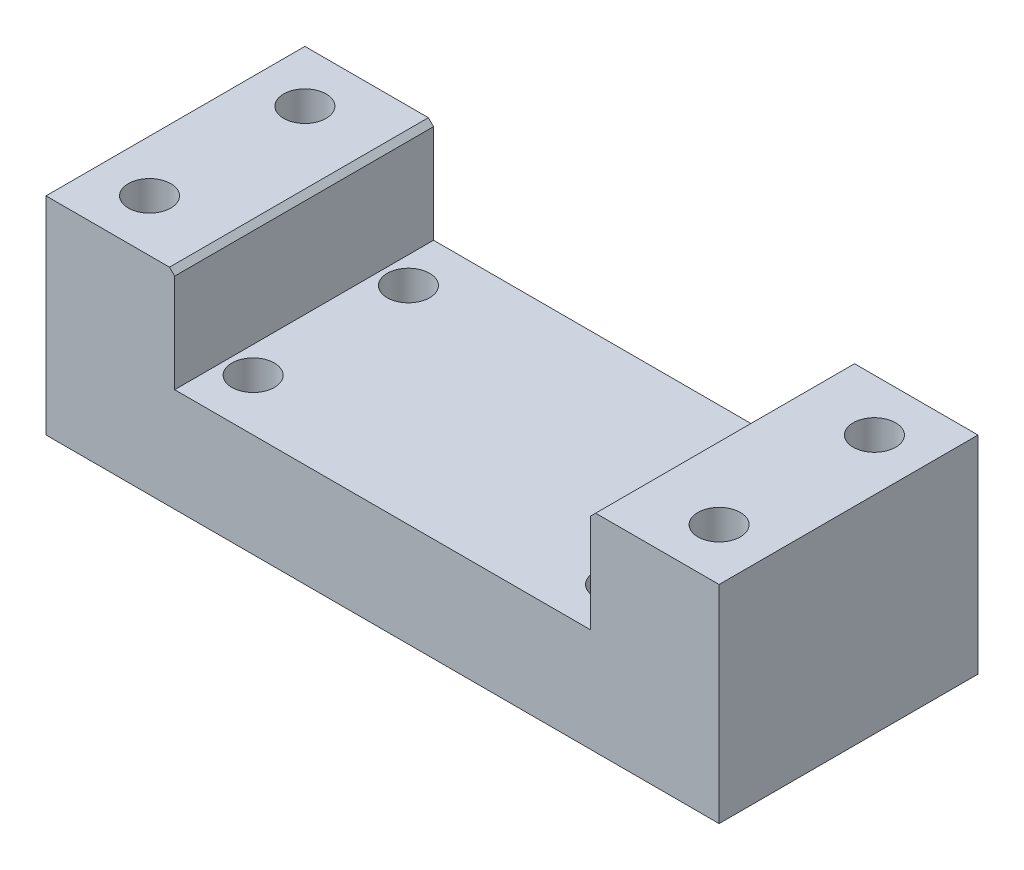
ISO-10303-21;
HEADER;
FILE_DESCRIPTION(('STEP AP214'),'2;1');
FILE_NAME('part.step','',(''),(''),'','','');
FILE_SCHEMA(('AUTOMOTIVE_DESIGN { 1 0 10303 214 1 1 1 1 }'));
ENDSEC;
DATA;
#1=APPLICATION_CONTEXT('core data for automotive mechanical design processes');
#2=APPLICATION_PROTOCOL_DEFINITION('international standard','automotive_design',2000,#1);
#3=PRODUCT_CONTEXT('',#1,'mechanical');
#4=PRODUCT('Part','Part','',(#3));
#5=PRODUCT_RELATED_PRODUCT_CATEGORY('part','',(#4));
#6=PRODUCT_DEFINITION_FORMATION('','',#4);
#7=PRODUCT_DEFINITION_CONTEXT('part definition',#1,'design');
#8=PRODUCT_DEFINITION('design','',#6,#7);
#9=PRODUCT_DEFINITION_SHAPE('','',#8);
#10=(LENGTH_UNIT() NAMED_UNIT(*) SI_UNIT(.MILLI.,.METRE.));
#11=(NAMED_UNIT(*) PLANE_ANGLE_UNIT() SI_UNIT($,.RADIAN.));
#12=(NAMED_UNIT(*) SI_UNIT($,.STERADIAN.) SOLID_ANGLE_UNIT());
#13=UNCERTAINTY_MEASURE_WITH_UNIT(LENGTH_MEASURE(1.E-05),#10,'distance_accuracy_value','');
#14=(GEOMETRIC_REPRESENTATION_CONTEXT(3) GLOBAL_UNCERTAINTY_ASSIGNED_CONTEXT((#13)) GLOBAL_UNIT_ASSIGNED_CONTEXT((#10,
#11,#12)) REPRESENTATION_CONTEXT('',''));
#15=CARTESIAN_POINT('',(0.,0.,0.));
#16=DIRECTION('',(0.,0.,1.));
#17=DIRECTION('',(1.,0.,0.));
#18=AXIS2_PLACEMENT_3D('',#15,#16,#17);
#19=CARTESIAN_POINT('',(0.,40.,0.));
#20=DIRECTION('',(0.,1.,0.));
#21=DIRECTION('',(0.,0.,1.));
#22=AXIS2_PLACEMENT_3D('',#19,#20,#21);
#23=PLANE('',#22);
#24=CARTESIAN_POINT('',(-55.,40.,-15.));
#25=DIRECTION('',(0.,-1.,0.));
#26=DIRECTION('',(0.,0.,-1.));
#27=AXIS2_PLACEMENT_3D('',#24,#25,#26);
#28=CIRCLE('',#27,4.1);
#29=CARTESIAN_POINT('',(-55.,40.,-19.1));
#30=VERTEX_POINT('',#29);
#31=EDGE_CURVE('E277',#30,#30,#28,.T.);
#32=ORIENTED_EDGE('',*,*,#31,.T.);
#33=EDGE_LOOP('',(#32));
#34=FACE_BOUND('',#33,.T.);
#35=CARTESIAN_POINT('',(-55.,40.,15.));
#36=DIRECTION('',(0.,-1.,0.));
#37=DIRECTION('',(0.,0.,-1.));
#38=AXIS2_PLACEMENT_3D('',#35,#36,#37);
#39=CIRCLE('',#38,4.1);
#40=CARTESIAN_POINT('',(-55.,40.,10.9));
#41=VERTEX_POINT('',#40);
#42=EDGE_CURVE('E270',#41,#41,#39,.T.);
#43=ORIENTED_EDGE('',*,*,#42,.T.);
#44=EDGE_LOOP('',(#43));
#45=FACE_BOUND('',#44,.T.);
#46=DIRECTION('',(1.,0.,0.));
#47=VECTOR('',#46,1.);
#48=CARTESIAN_POINT('',(65.,40.,25.));
#49=LINE('',#48,#47);
#50=CARTESIAN_POINT('',(-65.,40.,25.));
#51=VERTEX_POINT('',#50);
#52=CARTESIAN_POINT('',(-41.15,40.,25.));
#53=VERTEX_POINT('',#52);
#54=EDGE_CURVE('E155',#51,#53,#49,.T.);
#55=ORIENTED_EDGE('',*,*,#54,.T.);
#56=DIRECTION('',(0.,0.,-1.));
#57=VECTOR('',#56,1.);
#58=CARTESIAN_POINT('',(-41.15,40.,-25.));
#59=LINE('',#58,#57);
#60=CARTESIAN_POINT('',(-41.15,40.,-25.));
#61=VERTEX_POINT('',#60);
#62=EDGE_CURVE('E11',#53,#61,#59,.T.);
#63=ORIENTED_EDGE('',*,*,#62,.T.);
#64=DIRECTION('',(-1.,0.,0.));
#65=VECTOR('',#64,1.);
#66=CARTESIAN_POINT('',(65.,40.,-25.));
#67=LINE('',#66,#65);
#68=CARTESIAN_POINT('',(-65.,40.,-25.));
#69=VERTEX_POINT('',#68);
#70=EDGE_CURVE('E159',#61,#69,#67,.T.);
#71=ORIENTED_EDGE('',*,*,#70,.T.);
#72=DIRECTION('',(0.,0.,1.));
#73=VECTOR('',#72,1.);
#74=CARTESIAN_POINT('',(-65.,40.,25.));
#75=LINE('',#74,#73);
#76=EDGE_CURVE('E150',#69,#51,#75,.T.);
#77=ORIENTED_EDGE('',*,*,#76,.T.);
#78=EDGE_LOOP('',(#55,#63,#71,#77));
#79=FACE_BOUND('',#78,.T.);
#80=ADVANCED_FACE('F38',(#34,#45,#79),#23,.T.);
#81=CARTESIAN_POINT('',(-65.,40.,25.));
#82=DIRECTION('',(1.,0.,0.));
#83=DIRECTION('',(0.,0.,-1.));
#84=AXIS2_PLACEMENT_3D('',#81,#82,#83);
#85=PLANE('',#84);
#86=DIRECTION('',(0.,0.,1.));
#87=VECTOR('',#86,1.);
#88=CARTESIAN_POINT('',(-65.,0.,25.));
#89=LINE('',#88,#87);
#90=CARTESIAN_POINT('',(-65.,0.,-25.));
#91=VERTEX_POINT('',#90);
#92=CARTESIAN_POINT('',(-65.,0.,25.));
#93=VERTEX_POINT('',#92);
#94=EDGE_CURVE('E148',#91,#93,#89,.T.);
#95=ORIENTED_EDGE('',*,*,#94,.T.);
#96=DIRECTION('',(0.,-1.,0.));
#97=VECTOR('',#96,1.);
#98=CARTESIAN_POINT('',(-65.,40.,25.));
#99=LINE('',#98,#97);
#100=EDGE_CURVE('E179',#51,#93,#99,.T.);
#101=ORIENTED_EDGE('',*,*,#100,.F.);
#102=ORIENTED_EDGE('',*,*,#76,.F.);
#103=DIRECTION('',(0.,-1.,0.));
#104=VECTOR('',#103,1.);
#105=CARTESIAN_POINT('',(-65.,40.,-25.));
#106=LINE('',#105,#104);
#107=EDGE_CURVE('E163',#69,#91,#106,.T.);
#108=ORIENTED_EDGE('',*,*,#107,.T.);
#109=EDGE_LOOP('',(#95,#101,#102,#108));
#110=FACE_BOUND('',#109,.T.);
#111=ADVANCED_FACE('F231',(#110),#85,.F.);
#112=CARTESIAN_POINT('',(65.,40.,25.));
#113=DIRECTION('',(0.,0.,-1.));
#114=DIRECTION('',(-1.,0.,0.));
#115=AXIS2_PLACEMENT_3D('',#112,#113,#114);
#116=PLANE('',#115);
#117=CARTESIAN_POINT('',(41.15,40.,25.));
#118=VERTEX_POINT('',#117);
#119=CARTESIAN_POINT('',(65.,40.,25.));
#120=VERTEX_POINT('',#119);
#121=EDGE_CURVE('E153',#118,#120,#49,.T.);
#122=ORIENTED_EDGE('',*,*,#121,.F.);
#123=DIRECTION('',(-0.707106781186552,-0.707106781186543,0.));
#124=VECTOR('',#123,1.);
#125=CARTESIAN_POINT('',(40.15,39.,25.));
#126=LINE('',#125,#124);
#127=CARTESIAN_POINT('',(40.15,39.,25.));
#128=VERTEX_POINT('',#127);
#129=EDGE_CURVE('E204',#118,#128,#126,.T.);
#130=ORIENTED_EDGE('',*,*,#129,.T.);
#131=DIRECTION('',(0.,1.,0.));
#132=VECTOR('',#131,1.);
#133=CARTESIAN_POINT('',(40.15,60.,25.));
#134=LINE('',#133,#132);
#135=CARTESIAN_POINT('',(40.15,20.,25.));
#136=VERTEX_POINT('',#135);
#137=EDGE_CURVE('E124',#136,#128,#134,.T.);
#138=ORIENTED_EDGE('',*,*,#137,.F.);
#139=DIRECTION('',(1.,0.,0.));
#140=VECTOR('',#139,1.);
#141=CARTESIAN_POINT('',(40.15,20.,25.));
#142=LINE('',#141,#140);
#143=CARTESIAN_POINT('',(-40.15,20.,25.));
#144=VERTEX_POINT('',#143);
#145=EDGE_CURVE('E143',#144,#136,#142,.T.);
#146=ORIENTED_EDGE('',*,*,#145,.F.);
#147=DIRECTION('',(0.,-1.,0.));
#148=VECTOR('',#147,1.);
#149=CARTESIAN_POINT('',(-40.15,60.,25.));
#150=LINE('',#149,#148);
#151=CARTESIAN_POINT('',(-40.15,39.,25.));
#152=VERTEX_POINT('',#151);
#153=EDGE_CURVE('E129',#152,#144,#150,.T.);
#154=ORIENTED_EDGE('',*,*,#153,.F.);
#155=DIRECTION('',(-0.707106781186552,0.707106781186543,0.));
#156=VECTOR('',#155,1.);
#157=CARTESIAN_POINT('',(-40.15,39.,25.));
#158=LINE('',#157,#156);
#159=EDGE_CURVE('E53',#152,#53,#158,.T.);
#160=ORIENTED_EDGE('',*,*,#159,.T.);
#161=ORIENTED_EDGE('',*,*,#54,.F.);
#162=ORIENTED_EDGE('',*,*,#100,.T.);
#163=DIRECTION('',(1.,0.,0.));
#164=VECTOR('',#163,1.);
#165=CARTESIAN_POINT('',(65.,0.,25.));
#166=LINE('',#165,#164);
#167=CARTESIAN_POINT('',(65.,0.,25.));
#168=VERTEX_POINT('',#167);
#169=EDGE_CURVE('E166',#93,#168,#166,.T.);
#170=ORIENTED_EDGE('',*,*,#169,.T.);
#171=DIRECTION('',(0.,-1.,0.));
#172=VECTOR('',#171,1.);
#173=CARTESIAN_POINT('',(65.,40.,25.));
#174=LINE('',#173,#172);
#175=EDGE_CURVE('E176',#120,#168,#174,.T.);
#176=ORIENTED_EDGE('',*,*,#175,.F.);
#177=EDGE_LOOP('',(#122,#130,#138,#146,#154,#160,#161,#162,#170,#176));
#178=FACE_BOUND('',#177,.T.);
#179=ADVANCED_FACE('F206',(#178),#116,.F.);
#180=CARTESIAN_POINT('',(65.,40.,25.));
#181=DIRECTION('',(-1.,0.,0.));
#182=DIRECTION('',(0.,0.,1.));
#183=AXIS2_PLACEMENT_3D('',#180,#181,#182);
#184=PLANE('',#183);
#185=DIRECTION('',(0.,0.,-1.));
#186=VECTOR('',#185,1.);
#187=CARTESIAN_POINT('',(65.,0.,25.));
#188=LINE('',#187,#186);
#189=CARTESIAN_POINT('',(65.,0.,-25.));
#190=VERTEX_POINT('',#189);
#191=EDGE_CURVE('E168',#168,#190,#188,.T.);
#192=ORIENTED_EDGE('',*,*,#191,.T.);
#193=DIRECTION('',(0.,-1.,0.));
#194=VECTOR('',#193,1.);
#195=CARTESIAN_POINT('',(65.,40.,-25.));
#196=LINE('',#195,#194);
#197=CARTESIAN_POINT('',(65.,40.,-25.));
#198=VERTEX_POINT('',#197);
#199=EDGE_CURVE('E173',#198,#190,#196,.T.);
#200=ORIENTED_EDGE('',*,*,#199,.F.);
#201=DIRECTION('',(0.,0.,-1.));
#202=VECTOR('',#201,1.);
#203=CARTESIAN_POINT('',(65.,40.,25.));
#204=LINE('',#203,#202);
#205=EDGE_CURVE('E157',#120,#198,#204,.T.);
#206=ORIENTED_EDGE('',*,*,#205,.F.);
#207=ORIENTED_EDGE('',*,*,#175,.T.);
#208=EDGE_LOOP('',(#192,#200,#206,#207));
#209=FACE_BOUND('',#208,.T.);
#210=ADVANCED_FACE('F222',(#209),#184,.F.);
#211=CARTESIAN_POINT('',(65.,40.,-25.));
#212=DIRECTION('',(0.,0.,1.));
#213=DIRECTION('',(1.,0.,0.));
#214=AXIS2_PLACEMENT_3D('',#211,#212,#213);
#215=PLANE('',#214);
#216=DIRECTION('',(0.,1.,0.));
#217=VECTOR('',#216,1.);
#218=CARTESIAN_POINT('',(40.15,60.,-25.));
#219=LINE('',#218,#217);
#220=CARTESIAN_POINT('',(40.15,20.,-25.));
#221=VERTEX_POINT('',#220);
#222=CARTESIAN_POINT('',(40.15,39.,-25.));
#223=VERTEX_POINT('',#222);
#224=EDGE_CURVE('E134',#221,#223,#219,.T.);
#225=ORIENTED_EDGE('',*,*,#224,.T.);
#226=DIRECTION('',(0.707106781186552,0.707106781186543,0.));
#227=VECTOR('',#226,1.);
#228=CARTESIAN_POINT('',(40.15,39.,-25.));
#229=LINE('',#228,#227);
#230=CARTESIAN_POINT('',(41.15,40.,-25.));
#231=VERTEX_POINT('',#230);
#232=EDGE_CURVE('E199',#223,#231,#229,.T.);
#233=ORIENTED_EDGE('',*,*,#232,.T.);
#234=EDGE_CURVE('E160',#198,#231,#67,.T.);
#235=ORIENTED_EDGE('',*,*,#234,.F.);
#236=ORIENTED_EDGE('',*,*,#199,.T.);
#237=DIRECTION('',(-1.,0.,0.));
#238=VECTOR('',#237,1.);
#239=CARTESIAN_POINT('',(65.,0.,-25.));
#240=LINE('',#239,#238);
#241=EDGE_CURVE('E154',#190,#91,#240,.T.);
#242=ORIENTED_EDGE('',*,*,#241,.T.);
#243=ORIENTED_EDGE('',*,*,#107,.F.);
#244=ORIENTED_EDGE('',*,*,#70,.F.);
#245=DIRECTION('',(0.707106781186552,-0.707106781186543,0.));
#246=VECTOR('',#245,1.);
#247=CARTESIAN_POINT('',(-40.15,39.,-25.));
#248=LINE('',#247,#246);
#249=CARTESIAN_POINT('',(-40.15,39.,-25.));
#250=VERTEX_POINT('',#249);
#251=EDGE_CURVE('E122',#61,#250,#248,.T.);
#252=ORIENTED_EDGE('',*,*,#251,.T.);
#253=DIRECTION('',(0.,-1.,0.));
#254=VECTOR('',#253,1.);
#255=CARTESIAN_POINT('',(-40.15,60.,-25.));
#256=LINE('',#255,#254);
#257=CARTESIAN_POINT('',(-40.15,20.,-25.));
#258=VERTEX_POINT('',#257);
#259=EDGE_CURVE('E114',#250,#258,#256,.T.);
#260=ORIENTED_EDGE('',*,*,#259,.T.);
#261=DIRECTION('',(1.,0.,0.));
#262=VECTOR('',#261,1.);
#263=CARTESIAN_POINT('',(40.15,20.,-25.));
#264=LINE('',#263,#262);
#265=EDGE_CURVE('E119',#258,#221,#264,.T.);
#266=ORIENTED_EDGE('',*,*,#265,.T.);
#267=EDGE_LOOP('',(#225,#233,#235,#236,#242,#243,#244,#252,#260,#266));
#268=FACE_BOUND('',#267,.T.);
#269=ADVANCED_FACE('F117',(#268),#215,.F.);
#270=CARTESIAN_POINT('',(55.,40.,15.));
#271=DIRECTION('',(0.,-1.,0.));
#272=DIRECTION('',(0.,0.,-1.));
#273=AXIS2_PLACEMENT_3D('',#270,#271,#272);
#274=CIRCLE('',#273,4.1);
#275=CARTESIAN_POINT('',(55.,40.,10.9));
#276=VERTEX_POINT('',#275);
#277=EDGE_CURVE('E256',#276,#276,#274,.T.);
#278=ORIENTED_EDGE('',*,*,#277,.T.);
#279=EDGE_LOOP('',(#278));
#280=FACE_BOUND('',#279,.T.);
#281=CARTESIAN_POINT('',(55.,40.,-15.));
#282=DIRECTION('',(0.,-1.,0.));
#283=DIRECTION('',(0.,0.,-1.));
#284=AXIS2_PLACEMENT_3D('',#281,#282,#283);
#285=CIRCLE('',#284,4.1);
#286=CARTESIAN_POINT('',(55.,40.,-19.1));
#287=VERTEX_POINT('',#286);
#288=EDGE_CURVE('E259',#287,#287,#285,.T.);
#289=ORIENTED_EDGE('',*,*,#288,.T.);
#290=EDGE_LOOP('',(#289));
#291=FACE_BOUND('',#290,.T.);
#292=ORIENTED_EDGE('',*,*,#234,.T.);
#293=DIRECTION('',(0.,0.,1.));
#294=VECTOR('',#293,1.);
#295=CARTESIAN_POINT('',(41.15,40.,25.));
#296=LINE('',#295,#294);
#297=EDGE_CURVE('E201',#231,#118,#296,.T.);
#298=ORIENTED_EDGE('',*,*,#297,.T.);
#299=ORIENTED_EDGE('',*,*,#121,.T.);
#300=ORIENTED_EDGE('',*,*,#205,.T.);
#301=EDGE_LOOP('',(#292,#298,#299,#300));
#302=FACE_BOUND('',#301,.T.);
#303=ADVANCED_FACE('F217',(#280,#291,#302),#23,.T.);
#304=CARTESIAN_POINT('',(0.,0.,0.));
#305=DIRECTION('',(0.,1.,0.));
#306=DIRECTION('',(0.,0.,1.));
#307=AXIS2_PLACEMENT_3D('',#304,#305,#306);
#308=PLANE('',#307);
#309=CARTESIAN_POINT('',(-55.,0.,-15.));
#310=DIRECTION('',(0.,-1.,0.));
#311=DIRECTION('',(0.,0.,-1.));
#312=AXIS2_PLACEMENT_3D('',#309,#310,#311);
#313=CIRCLE('',#312,4.1);
#314=CARTESIAN_POINT('',(-55.,0.,-19.1));
#315=VERTEX_POINT('',#314);
#316=EDGE_CURVE('E466',#315,#315,#313,.T.);
#317=ORIENTED_EDGE('',*,*,#316,.F.);
#318=EDGE_LOOP('',(#317));
#319=FACE_BOUND('',#318,.T.);
#320=CARTESIAN_POINT('',(55.,0.,15.));
#321=DIRECTION('',(0.,-1.,0.));
#322=DIRECTION('',(0.,0.,-1.));
#323=AXIS2_PLACEMENT_3D('',#320,#321,#322);
#324=CIRCLE('',#323,4.1);
#325=CARTESIAN_POINT('',(55.,0.,10.9));
#326=VERTEX_POINT('',#325);
#327=EDGE_CURVE('E261',#326,#326,#324,.T.);
#328=ORIENTED_EDGE('',*,*,#327,.F.);
#329=EDGE_LOOP('',(#328));
#330=FACE_BOUND('',#329,.T.);
#331=CARTESIAN_POINT('',(55.,0.,-15.));
#332=DIRECTION('',(0.,-1.,0.));
#333=DIRECTION('',(0.,0.,-1.));
#334=AXIS2_PLACEMENT_3D('',#331,#332,#333);
#335=CIRCLE('',#334,4.1);
#336=CARTESIAN_POINT('',(55.,0.,-19.1));
#337=VERTEX_POINT('',#336);
#338=EDGE_CURVE('E262',#337,#337,#335,.T.);
#339=ORIENTED_EDGE('',*,*,#338,.F.);
#340=EDGE_LOOP('',(#339));
#341=FACE_BOUND('',#340,.T.);
#342=CARTESIAN_POINT('',(-55.,0.,15.));
#343=DIRECTION('',(0.,-1.,0.));
#344=DIRECTION('',(0.,0.,-1.));
#345=AXIS2_PLACEMENT_3D('',#342,#343,#344);
#346=CIRCLE('',#345,4.1);
#347=CARTESIAN_POINT('',(-55.,0.,10.9));
#348=VERTEX_POINT('',#347);
#349=EDGE_CURVE('E274',#348,#348,#346,.T.);
#350=ORIENTED_EDGE('',*,*,#349,.F.);
#351=EDGE_LOOP('',(#350));
#352=FACE_BOUND('',#351,.T.);
#353=CARTESIAN_POINT('',(-35.,0.,-15.));
#354=DIRECTION('',(0.,-1.,0.));
#355=DIRECTION('',(0.,0.,-1.));
#356=AXIS2_PLACEMENT_3D('',#353,#354,#355);
#357=CIRCLE('',#356,4.1);
#358=CARTESIAN_POINT('',(-35.,0.,-19.1));
#359=VERTEX_POINT('',#358);
#360=EDGE_CURVE('E190',#359,#359,#357,.T.);
#361=ORIENTED_EDGE('',*,*,#360,.F.);
#362=EDGE_LOOP('',(#361));
#363=FACE_BOUND('',#362,.T.);
#364=CARTESIAN_POINT('',(35.,0.,-14.2172732356869));
#365=DIRECTION('',(0.,-1.,0.));
#366=DIRECTION('',(0.,0.,-1.));
#367=AXIS2_PLACEMENT_3D('',#364,#365,#366);
#368=CIRCLE('',#367,4.1);
#369=CARTESIAN_POINT('',(35.,0.,-18.3172732356869));
#370=VERTEX_POINT('',#369);
#371=EDGE_CURVE('E280',#370,#370,#368,.T.);
#372=ORIENTED_EDGE('',*,*,#371,.F.);
#373=EDGE_LOOP('',(#372));
#374=FACE_BOUND('',#373,.T.);
#375=CARTESIAN_POINT('',(35.,0.,15.));
#376=DIRECTION('',(0.,-1.,0.));
#377=DIRECTION('',(0.,0.,-1.));
#378=AXIS2_PLACEMENT_3D('',#375,#376,#377);
#379=CIRCLE('',#378,4.1);
#380=CARTESIAN_POINT('',(35.,0.,10.9));
#381=VERTEX_POINT('',#380);
#382=EDGE_CURVE('E273',#381,#381,#379,.T.);
#383=ORIENTED_EDGE('',*,*,#382,.F.);
#384=EDGE_LOOP('',(#383));
#385=FACE_BOUND('',#384,.T.);
#386=CARTESIAN_POINT('',(-35.,0.,15.));
#387=DIRECTION('',(0.,-1.,0.));
#388=DIRECTION('',(0.,0.,-1.));
#389=AXIS2_PLACEMENT_3D('',#386,#387,#388);
#390=CIRCLE('',#389,4.1);
#391=CARTESIAN_POINT('',(-35.,0.,10.9));
#392=VERTEX_POINT('',#391);
#393=EDGE_CURVE('E185',#392,#392,#390,.T.);
#394=ORIENTED_EDGE('',*,*,#393,.F.);
#395=EDGE_LOOP('',(#394));
#396=FACE_BOUND('',#395,.T.);
#397=ORIENTED_EDGE('',*,*,#94,.F.);
#398=ORIENTED_EDGE('',*,*,#241,.F.);
#399=ORIENTED_EDGE('',*,*,#191,.F.);
#400=ORIENTED_EDGE('',*,*,#169,.F.);
#401=EDGE_LOOP('',(#397,#398,#399,#400));
#402=FACE_BOUND('',#401,.T.);
#403=ADVANCED_FACE('F228',(#319,#330,#341,#352,#363,#374,#385,#396,#402),#308,.F.);
#404=CARTESIAN_POINT('',(-40.15,60.,-25.));
#405=DIRECTION('',(-1.,0.,0.));
#406=DIRECTION('',(0.,-1.,0.));
#407=AXIS2_PLACEMENT_3D('',#404,#405,#406);
#408=PLANE('',#407);
#409=ORIENTED_EDGE('',*,*,#259,.F.);
#410=DIRECTION('',(0.,0.,1.));
#411=VECTOR('',#410,1.);
#412=CARTESIAN_POINT('',(-40.15,39.,25.));
#413=LINE('',#412,#411);
#414=EDGE_CURVE('E46',#250,#152,#413,.T.);
#415=ORIENTED_EDGE('',*,*,#414,.T.);
#416=ORIENTED_EDGE('',*,*,#153,.T.);
#417=DIRECTION('',(0.,0.,1.));
#418=VECTOR('',#417,1.);
#419=CARTESIAN_POINT('',(-40.15,20.,-25.));
#420=LINE('',#419,#418);
#421=EDGE_CURVE('E127',#258,#144,#420,.T.);
#422=ORIENTED_EDGE('',*,*,#421,.F.);
#423=EDGE_LOOP('',(#409,#415,#416,#422));
#424=FACE_BOUND('',#423,.T.);
#425=ADVANCED_FACE('F128',(#424),#408,.F.);
#426=CARTESIAN_POINT('',(40.15,60.,-25.));
#427=DIRECTION('',(1.,0.,0.));
#428=DIRECTION('',(0.,0.,-1.));
#429=AXIS2_PLACEMENT_3D('',#426,#427,#428);
#430=PLANE('',#429);
#431=ORIENTED_EDGE('',*,*,#137,.T.);
#432=DIRECTION('',(0.,0.,-1.));
#433=VECTOR('',#432,1.);
#434=CARTESIAN_POINT('',(40.15,39.,-25.));
#435=LINE('',#434,#433);
#436=EDGE_CURVE('E182',#128,#223,#435,.T.);
#437=ORIENTED_EDGE('',*,*,#436,.T.);
#438=ORIENTED_EDGE('',*,*,#224,.F.);
#439=DIRECTION('',(0.,0.,1.));
#440=VECTOR('',#439,1.);
#441=CARTESIAN_POINT('',(40.15,20.,-25.));
#442=LINE('',#441,#440);
#443=EDGE_CURVE('E133',#221,#136,#442,.T.);
#444=ORIENTED_EDGE('',*,*,#443,.T.);
#445=EDGE_LOOP('',(#431,#437,#438,#444));
#446=FACE_BOUND('',#445,.T.);
#447=ADVANCED_FACE('F211',(#446),#430,.F.);
#448=CARTESIAN_POINT('',(40.15,20.,-25.));
#449=DIRECTION('',(0.,-1.,0.));
#450=DIRECTION('',(1.,0.,0.));
#451=AXIS2_PLACEMENT_3D('',#448,#449,#450);
#452=PLANE('',#451);
#453=CARTESIAN_POINT('',(-35.,20.,-15.));
#454=DIRECTION('',(0.,-1.,0.));
#455=DIRECTION('',(1.,0.,0.));
#456=AXIS2_PLACEMENT_3D('',#453,#454,#455);
#457=CIRCLE('',#456,4.1);
#458=CARTESIAN_POINT('',(-30.9,20.,-15.));
#459=VERTEX_POINT('',#458);
#460=EDGE_CURVE('E193',#459,#459,#457,.T.);
#461=ORIENTED_EDGE('',*,*,#460,.T.);
#462=EDGE_LOOP('',(#461));
#463=FACE_BOUND('',#462,.T.);
#464=CARTESIAN_POINT('',(35.,20.,-14.2172732356869));
#465=DIRECTION('',(0.,-1.,0.));
#466=DIRECTION('',(1.,0.,0.));
#467=AXIS2_PLACEMENT_3D('',#464,#465,#466);
#468=CIRCLE('',#467,4.1);
#469=CARTESIAN_POINT('',(39.1,20.,-14.2172732356869));
#470=VERTEX_POINT('',#469);
#471=EDGE_CURVE('E189',#470,#470,#468,.T.);
#472=ORIENTED_EDGE('',*,*,#471,.T.);
#473=EDGE_LOOP('',(#472));
#474=FACE_BOUND('',#473,.T.);
#475=CARTESIAN_POINT('',(35.,20.,15.));
#476=DIRECTION('',(0.,-1.,0.));
#477=DIRECTION('',(1.,0.,0.));
#478=AXIS2_PLACEMENT_3D('',#475,#476,#477);
#479=CIRCLE('',#478,4.1);
#480=CARTESIAN_POINT('',(39.1,20.,15.));
#481=VERTEX_POINT('',#480);
#482=EDGE_CURVE('E186',#481,#481,#479,.T.);
#483=ORIENTED_EDGE('',*,*,#482,.T.);
#484=EDGE_LOOP('',(#483));
#485=FACE_BOUND('',#484,.T.);
#486=CARTESIAN_POINT('',(-35.,20.,15.));
#487=DIRECTION('',(0.,-1.,0.));
#488=DIRECTION('',(1.,0.,0.));
#489=AXIS2_PLACEMENT_3D('',#486,#487,#488);
#490=CIRCLE('',#489,4.1);
#491=CARTESIAN_POINT('',(-30.9,20.,15.));
#492=VERTEX_POINT('',#491);
#493=EDGE_CURVE('E144',#492,#492,#490,.T.);
#494=ORIENTED_EDGE('',*,*,#493,.T.);
#495=EDGE_LOOP('',(#494));
#496=FACE_BOUND('',#495,.T.);
#497=ORIENTED_EDGE('',*,*,#145,.T.);
#498=ORIENTED_EDGE('',*,*,#443,.F.);
#499=ORIENTED_EDGE('',*,*,#265,.F.);
#500=ORIENTED_EDGE('',*,*,#421,.T.);
#501=EDGE_LOOP('',(#497,#498,#499,#500));
#502=FACE_BOUND('',#501,.T.);
#503=ADVANCED_FACE('F136',(#463,#474,#485,#496,#502),#452,.F.);
#504=CARTESIAN_POINT('',(-35.,40.,15.));
#505=DIRECTION('',(0.,-1.,0.));
#506=DIRECTION('',(0.,0.,-1.));
#507=AXIS2_PLACEMENT_3D('',#504,#505,#506);
#508=CYLINDRICAL_SURFACE('',#507,4.1);
#509=ORIENTED_EDGE('',*,*,#393,.T.);
#510=EDGE_LOOP('',(#509));
#511=FACE_BOUND('',#510,.T.);
#512=ORIENTED_EDGE('',*,*,#493,.F.);
#513=EDGE_LOOP('',(#512));
#514=FACE_BOUND('',#513,.T.);
#515=ADVANCED_FACE('F287',(#511,#514),#508,.F.);
#516=CARTESIAN_POINT('',(35.,40.,15.));
#517=DIRECTION('',(0.,-1.,0.));
#518=DIRECTION('',(0.,0.,-1.));
#519=AXIS2_PLACEMENT_3D('',#516,#517,#518);
#520=CYLINDRICAL_SURFACE('',#519,4.1);
#521=ORIENTED_EDGE('',*,*,#382,.T.);
#522=EDGE_LOOP('',(#521));
#523=FACE_BOUND('',#522,.T.);
#524=ORIENTED_EDGE('',*,*,#482,.F.);
#525=EDGE_LOOP('',(#524));
#526=FACE_BOUND('',#525,.T.);
#527=ADVANCED_FACE('F291',(#523,#526),#520,.F.);
#528=CARTESIAN_POINT('',(35.,40.,-14.2172732356869));
#529=DIRECTION('',(0.,-1.,0.));
#530=DIRECTION('',(0.,0.,-1.));
#531=AXIS2_PLACEMENT_3D('',#528,#529,#530);
#532=CYLINDRICAL_SURFACE('',#531,4.1);
#533=ORIENTED_EDGE('',*,*,#371,.T.);
#534=EDGE_LOOP('',(#533));
#535=FACE_BOUND('',#534,.T.);
#536=ORIENTED_EDGE('',*,*,#471,.F.);
#537=EDGE_LOOP('',(#536));
#538=FACE_BOUND('',#537,.T.);
#539=ADVANCED_FACE('F391',(#535,#538),#532,.F.);
#540=CARTESIAN_POINT('',(-35.,40.,-15.));
#541=DIRECTION('',(0.,-1.,0.));
#542=DIRECTION('',(0.,0.,-1.));
#543=AXIS2_PLACEMENT_3D('',#540,#541,#542);
#544=CYLINDRICAL_SURFACE('',#543,4.1);
#545=ORIENTED_EDGE('',*,*,#360,.T.);
#546=EDGE_LOOP('',(#545));
#547=FACE_BOUND('',#546,.T.);
#548=ORIENTED_EDGE('',*,*,#460,.F.);
#549=EDGE_LOOP('',(#548));
#550=FACE_BOUND('',#549,.T.);
#551=ADVANCED_FACE('F323',(#547,#550),#544,.F.);
#552=CARTESIAN_POINT('',(40.15,39.,-25.));
#553=DIRECTION('',(-0.707106781186543,0.707106781186552,0.));
#554=DIRECTION('',(0.,0.,1.));
#555=AXIS2_PLACEMENT_3D('',#552,#553,#554);
#556=PLANE('',#555);
#557=ORIENTED_EDGE('',*,*,#129,.F.);
#558=ORIENTED_EDGE('',*,*,#297,.F.);
#559=ORIENTED_EDGE('',*,*,#232,.F.);
#560=ORIENTED_EDGE('',*,*,#436,.F.);
#561=EDGE_LOOP('',(#557,#558,#559,#560));
#562=FACE_BOUND('',#561,.T.);
#563=ADVANCED_FACE('F213',(#562),#556,.T.);
#564=CARTESIAN_POINT('',(-40.15,39.,-25.));
#565=DIRECTION('',(0.707106781186543,0.707106781186552,0.));
#566=DIRECTION('',(0.,0.,-1.));
#567=AXIS2_PLACEMENT_3D('',#564,#565,#566);
#568=PLANE('',#567);
#569=ORIENTED_EDGE('',*,*,#251,.F.);
#570=ORIENTED_EDGE('',*,*,#62,.F.);
#571=ORIENTED_EDGE('',*,*,#159,.F.);
#572=ORIENTED_EDGE('',*,*,#414,.F.);
#573=EDGE_LOOP('',(#569,#570,#571,#572));
#574=FACE_BOUND('',#573,.T.);
#575=ADVANCED_FACE('F40',(#574),#568,.T.);
#576=CARTESIAN_POINT('',(-55.,40.,15.));
#577=DIRECTION('',(0.,-1.,0.));
#578=DIRECTION('',(0.,0.,-1.));
#579=AXIS2_PLACEMENT_3D('',#576,#577,#578);
#580=CYLINDRICAL_SURFACE('',#579,4.1);
#581=ORIENTED_EDGE('',*,*,#42,.F.);
#582=EDGE_LOOP('',(#581));
#583=FACE_BOUND('',#582,.T.);
#584=ORIENTED_EDGE('',*,*,#349,.T.);
#585=EDGE_LOOP('',(#584));
#586=FACE_BOUND('',#585,.T.);
#587=ADVANCED_FACE('F332',(#583,#586),#580,.F.);
#588=CARTESIAN_POINT('',(55.,40.,-15.));
#589=DIRECTION('',(0.,-1.,0.));
#590=DIRECTION('',(0.,0.,-1.));
#591=AXIS2_PLACEMENT_3D('',#588,#589,#590);
#592=CYLINDRICAL_SURFACE('',#591,4.1);
#593=ORIENTED_EDGE('',*,*,#288,.F.);
#594=EDGE_LOOP('',(#593));
#595=FACE_BOUND('',#594,.T.);
#596=ORIENTED_EDGE('',*,*,#338,.T.);
#597=EDGE_LOOP('',(#596));
#598=FACE_BOUND('',#597,.T.);
#599=ADVANCED_FACE('F354',(#595,#598),#592,.F.);
#600=CARTESIAN_POINT('',(55.,40.,15.));
#601=DIRECTION('',(0.,-1.,0.));
#602=DIRECTION('',(0.,0.,-1.));
#603=AXIS2_PLACEMENT_3D('',#600,#601,#602);
#604=CYLINDRICAL_SURFACE('',#603,4.1);
#605=ORIENTED_EDGE('',*,*,#277,.F.);
#606=EDGE_LOOP('',(#605));
#607=FACE_BOUND('',#606,.T.);
#608=ORIENTED_EDGE('',*,*,#327,.T.);
#609=EDGE_LOOP('',(#608));
#610=FACE_BOUND('',#609,.T.);
#611=ADVANCED_FACE('F364',(#607,#610),#604,.F.);
#612=CARTESIAN_POINT('',(-55.,40.,-15.));
#613=DIRECTION('',(0.,-1.,0.));
#614=DIRECTION('',(0.,0.,-1.));
#615=AXIS2_PLACEMENT_3D('',#612,#613,#614);
#616=CYLINDRICAL_SURFACE('',#615,4.1);
#617=ORIENTED_EDGE('',*,*,#31,.F.);
#618=EDGE_LOOP('',(#617));
#619=FACE_BOUND('',#618,.T.);
#620=ORIENTED_EDGE('',*,*,#316,.T.);
#621=EDGE_LOOP('',(#620));
#622=FACE_BOUND('',#621,.T.);
#623=ADVANCED_FACE('F373',(#619,#622),#616,.F.);
#624=CLOSED_SHELL('',(#80,#111,#179,#210,#269,#303,#403,#425,#447,#503,#515,#527,#539,#551,#563,
#575,#587,#599,#611,#623));
#625=MANIFOLD_SOLID_BREP('B2',#624);
#626=ADVANCED_BREP_SHAPE_REPRESENTATION('',(#18,#625),#14);
#627=SHAPE_DEFINITION_REPRESENTATION(#9,#626);
ENDSEC;
END-ISO-10303-21;
